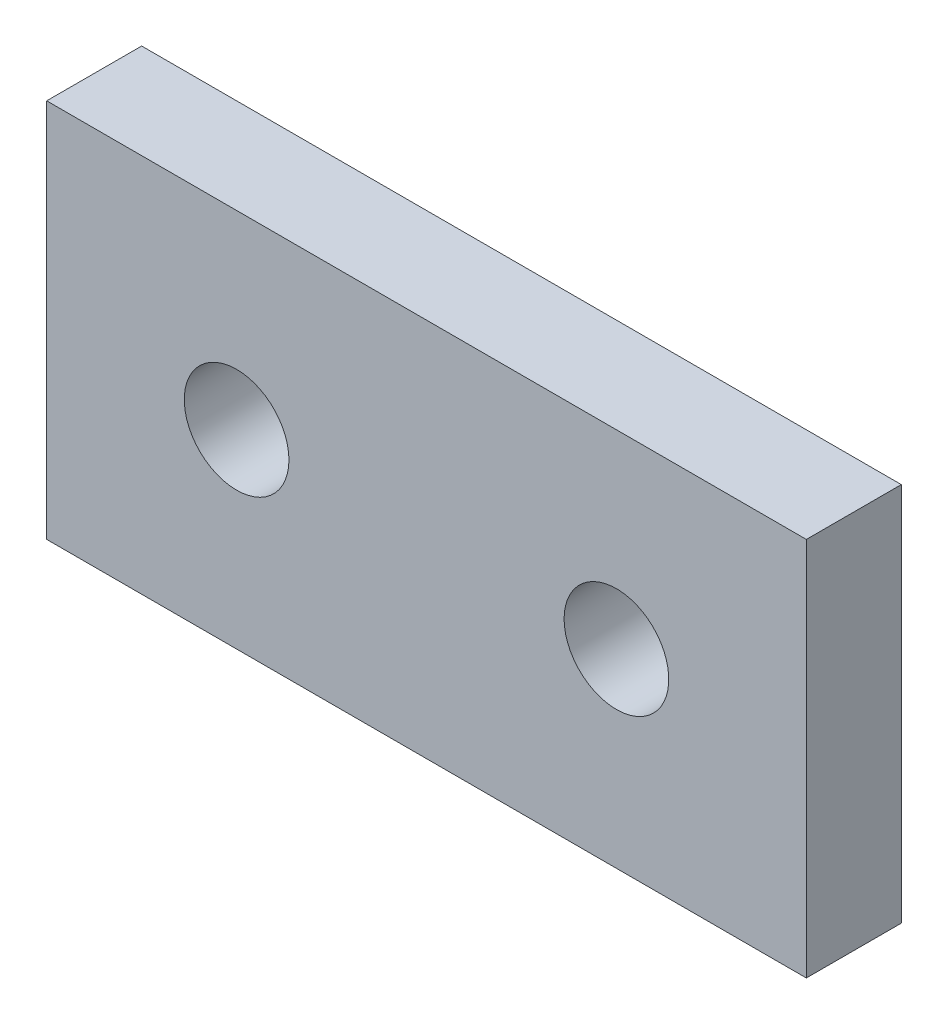
ISO-10303-21;
HEADER;
FILE_DESCRIPTION(('STEP AP214'),'2;1');
FILE_NAME('part.step','',(''),(''),'','','');
FILE_SCHEMA(('AUTOMOTIVE_DESIGN { 1 0 10303 214 1 1 1 1 }'));
ENDSEC;
DATA;
#1=APPLICATION_CONTEXT('core data for automotive mechanical design processes');
#2=APPLICATION_PROTOCOL_DEFINITION('international standard','automotive_design',2000,#1);
#3=PRODUCT_CONTEXT('',#1,'mechanical');
#4=PRODUCT('Part','Part','',(#3));
#5=PRODUCT_RELATED_PRODUCT_CATEGORY('part','',(#4));
#6=PRODUCT_DEFINITION_FORMATION('','',#4);
#7=PRODUCT_DEFINITION_CONTEXT('part definition',#1,'design');
#8=PRODUCT_DEFINITION('design','',#6,#7);
#9=PRODUCT_DEFINITION_SHAPE('','',#8);
#10=(LENGTH_UNIT() NAMED_UNIT(*) SI_UNIT(.MILLI.,.METRE.));
#11=(NAMED_UNIT(*) PLANE_ANGLE_UNIT() SI_UNIT($,.RADIAN.));
#12=(NAMED_UNIT(*) SI_UNIT($,.STERADIAN.) SOLID_ANGLE_UNIT());
#13=UNCERTAINTY_MEASURE_WITH_UNIT(LENGTH_MEASURE(1.E-05),#10,'distance_accuracy_value','');
#14=(GEOMETRIC_REPRESENTATION_CONTEXT(3) GLOBAL_UNCERTAINTY_ASSIGNED_CONTEXT((#13)) GLOBAL_UNIT_ASSIGNED_CONTEXT((#10,
#11,#12)) REPRESENTATION_CONTEXT('',''));
#15=CARTESIAN_POINT('',(0.,0.,0.));
#16=DIRECTION('',(0.,0.,1.));
#17=DIRECTION('',(1.,0.,0.));
#18=AXIS2_PLACEMENT_3D('',#15,#16,#17);
#19=CARTESIAN_POINT('',(0.,0.,6.35));
#20=DIRECTION('',(1.,0.,0.));
#21=DIRECTION('',(0.,0.,-1.));
#22=AXIS2_PLACEMENT_3D('',#19,#20,#21);
#23=PLANE('',#22);
#24=DIRECTION('',(0.,-1.,0.));
#25=VECTOR('',#24,1.);
#26=CARTESIAN_POINT('',(0.,0.,0.));
#27=LINE('',#26,#25);
#28=CARTESIAN_POINT('',(0.,25.4,0.));
#29=VERTEX_POINT('',#28);
#30=CARTESIAN_POINT('',(0.,0.,0.));
#31=VERTEX_POINT('',#30);
#32=EDGE_CURVE('E99',#29,#31,#27,.T.);
#33=ORIENTED_EDGE('',*,*,#32,.T.);
#34=DIRECTION('',(0.,0.,-1.));
#35=VECTOR('',#34,1.);
#36=CARTESIAN_POINT('',(0.,0.,6.35));
#37=LINE('',#36,#35);
#38=CARTESIAN_POINT('',(0.,0.,6.35));
#39=VERTEX_POINT('',#38);
#40=EDGE_CURVE('E11',#39,#31,#37,.T.);
#41=ORIENTED_EDGE('',*,*,#40,.F.);
#42=DIRECTION('',(0.,-1.,0.));
#43=VECTOR('',#42,1.);
#44=CARTESIAN_POINT('',(0.,0.,6.35));
#45=LINE('',#44,#43);
#46=CARTESIAN_POINT('',(0.,25.4,6.35));
#47=VERTEX_POINT('',#46);
#48=EDGE_CURVE('E87',#47,#39,#45,.T.);
#49=ORIENTED_EDGE('',*,*,#48,.F.);
#50=DIRECTION('',(0.,0.,-1.));
#51=VECTOR('',#50,1.);
#52=CARTESIAN_POINT('',(0.,25.4,6.35));
#53=LINE('',#52,#51);
#54=EDGE_CURVE('E95',#47,#29,#53,.T.);
#55=ORIENTED_EDGE('',*,*,#54,.T.);
#56=EDGE_LOOP('',(#33,#41,#49,#55));
#57=FACE_BOUND('',#56,.T.);
#58=ADVANCED_FACE('F36',(#57),#23,.F.);
#59=CARTESIAN_POINT('',(0.,0.,6.35));
#60=DIRECTION('',(0.,1.,0.));
#61=DIRECTION('',(0.,0.,1.));
#62=AXIS2_PLACEMENT_3D('',#59,#60,#61);
#63=PLANE('',#62);
#64=DIRECTION('',(1.,0.,0.));
#65=VECTOR('',#64,1.);
#66=CARTESIAN_POINT('',(0.,0.,0.));
#67=LINE('',#66,#65);
#68=CARTESIAN_POINT('',(50.8,0.,0.));
#69=VERTEX_POINT('',#68);
#70=EDGE_CURVE('E91',#31,#69,#67,.T.);
#71=ORIENTED_EDGE('',*,*,#70,.T.);
#72=DIRECTION('',(0.,0.,-1.));
#73=VECTOR('',#72,1.);
#74=CARTESIAN_POINT('',(50.8,0.,6.35));
#75=LINE('',#74,#73);
#76=CARTESIAN_POINT('',(50.8,0.,6.35));
#77=VERTEX_POINT('',#76);
#78=EDGE_CURVE('E44',#77,#69,#75,.T.);
#79=ORIENTED_EDGE('',*,*,#78,.F.);
#80=DIRECTION('',(1.,0.,0.));
#81=VECTOR('',#80,1.);
#82=CARTESIAN_POINT('',(0.,0.,6.35));
#83=LINE('',#82,#81);
#84=EDGE_CURVE('E82',#39,#77,#83,.T.);
#85=ORIENTED_EDGE('',*,*,#84,.F.);
#86=ORIENTED_EDGE('',*,*,#40,.T.);
#87=EDGE_LOOP('',(#71,#79,#85,#86));
#88=FACE_BOUND('',#87,.T.);
#89=ADVANCED_FACE('F90',(#88),#63,.F.);
#90=CARTESIAN_POINT('',(50.8,0.,6.35));
#91=DIRECTION('',(-1.,0.,0.));
#92=DIRECTION('',(0.,0.,1.));
#93=AXIS2_PLACEMENT_3D('',#90,#91,#92);
#94=PLANE('',#93);
#95=DIRECTION('',(0.,1.,0.));
#96=VECTOR('',#95,1.);
#97=CARTESIAN_POINT('',(50.8,0.,0.));
#98=LINE('',#97,#96);
#99=CARTESIAN_POINT('',(50.8,25.4,0.));
#100=VERTEX_POINT('',#99);
#101=EDGE_CURVE('E69',#69,#100,#98,.T.);
#102=ORIENTED_EDGE('',*,*,#101,.T.);
#103=DIRECTION('',(0.,0.,-1.));
#104=VECTOR('',#103,1.);
#105=CARTESIAN_POINT('',(50.8,25.4,6.35));
#106=LINE('',#105,#104);
#107=CARTESIAN_POINT('',(50.8,25.4,6.35));
#108=VERTEX_POINT('',#107);
#109=EDGE_CURVE('E92',#108,#100,#106,.T.);
#110=ORIENTED_EDGE('',*,*,#109,.F.);
#111=DIRECTION('',(0.,1.,0.));
#112=VECTOR('',#111,1.);
#113=CARTESIAN_POINT('',(50.8,0.,6.35));
#114=LINE('',#113,#112);
#115=EDGE_CURVE('E85',#77,#108,#114,.T.);
#116=ORIENTED_EDGE('',*,*,#115,.F.);
#117=ORIENTED_EDGE('',*,*,#78,.T.);
#118=EDGE_LOOP('',(#102,#110,#116,#117));
#119=FACE_BOUND('',#118,.T.);
#120=ADVANCED_FACE('F93',(#119),#94,.F.);
#121=CARTESIAN_POINT('',(0.,25.4,6.35));
#122=DIRECTION('',(0.,-1.,0.));
#123=DIRECTION('',(0.,0.,-1.));
#124=AXIS2_PLACEMENT_3D('',#121,#122,#123);
#125=PLANE('',#124);
#126=DIRECTION('',(-1.,0.,0.));
#127=VECTOR('',#126,1.);
#128=CARTESIAN_POINT('',(0.,25.4,0.));
#129=LINE('',#128,#127);
#130=EDGE_CURVE('E75',#100,#29,#129,.T.);
#131=ORIENTED_EDGE('',*,*,#130,.T.);
#132=ORIENTED_EDGE('',*,*,#54,.F.);
#133=DIRECTION('',(-1.,0.,0.));
#134=VECTOR('',#133,1.);
#135=CARTESIAN_POINT('',(0.,25.4,6.35));
#136=LINE('',#135,#134);
#137=EDGE_CURVE('E52',#108,#47,#136,.T.);
#138=ORIENTED_EDGE('',*,*,#137,.F.);
#139=ORIENTED_EDGE('',*,*,#109,.T.);
#140=EDGE_LOOP('',(#131,#132,#138,#139));
#141=FACE_BOUND('',#140,.T.);
#142=ADVANCED_FACE('F107',(#141),#125,.F.);
#143=CARTESIAN_POINT('',(0.,0.,6.35));
#144=DIRECTION('',(0.,0.,-1.));
#145=DIRECTION('',(-1.,0.,0.));
#146=AXIS2_PLACEMENT_3D('',#143,#144,#145);
#147=PLANE('',#146);
#148=CARTESIAN_POINT('',(12.7,12.7,6.35));
#149=DIRECTION('',(0.,0.,1.));
#150=DIRECTION('',(1.,0.,0.));
#151=AXIS2_PLACEMENT_3D('',#148,#149,#150);
#152=CIRCLE('',#151,3.5);
#153=CARTESIAN_POINT('',(16.2,12.7,6.35));
#154=VERTEX_POINT('',#153);
#155=EDGE_CURVE('E119',#154,#154,#152,.T.);
#156=ORIENTED_EDGE('',*,*,#155,.F.);
#157=EDGE_LOOP('',(#156));
#158=FACE_BOUND('',#157,.T.);
#159=CARTESIAN_POINT('',(38.1,12.7,6.35));
#160=DIRECTION('',(0.,0.,1.));
#161=DIRECTION('',(-1.,0.,0.));
#162=AXIS2_PLACEMENT_3D('',#159,#160,#161);
#163=CIRCLE('',#162,3.49999999999999);
#164=CARTESIAN_POINT('',(34.6,12.7,6.35));
#165=VERTEX_POINT('',#164);
#166=EDGE_CURVE('E113',#165,#165,#163,.T.);
#167=ORIENTED_EDGE('',*,*,#166,.F.);
#168=EDGE_LOOP('',(#167));
#169=FACE_BOUND('',#168,.T.);
#170=ORIENTED_EDGE('',*,*,#48,.T.);
#171=ORIENTED_EDGE('',*,*,#84,.T.);
#172=ORIENTED_EDGE('',*,*,#115,.T.);
#173=ORIENTED_EDGE('',*,*,#137,.T.);
#174=EDGE_LOOP('',(#170,#171,#172,#173));
#175=FACE_BOUND('',#174,.T.);
#176=ADVANCED_FACE('F83',(#158,#169,#175),#147,.F.);
#177=CARTESIAN_POINT('',(0.,0.,0.));
#178=DIRECTION('',(0.,0.,-1.));
#179=DIRECTION('',(-1.,0.,0.));
#180=AXIS2_PLACEMENT_3D('',#177,#178,#179);
#181=PLANE('',#180);
#182=CARTESIAN_POINT('',(12.7,12.7,0.));
#183=DIRECTION('',(0.,0.,1.));
#184=DIRECTION('',(1.,0.,0.));
#185=AXIS2_PLACEMENT_3D('',#182,#183,#184);
#186=CIRCLE('',#185,3.5);
#187=CARTESIAN_POINT('',(16.2,12.7,0.));
#188=VERTEX_POINT('',#187);
#189=EDGE_CURVE('E102',#188,#188,#186,.T.);
#190=ORIENTED_EDGE('',*,*,#189,.T.);
#191=EDGE_LOOP('',(#190));
#192=FACE_BOUND('',#191,.T.);
#193=CARTESIAN_POINT('',(38.1,12.7,0.));
#194=DIRECTION('',(0.,0.,1.));
#195=DIRECTION('',(-1.,0.,0.));
#196=AXIS2_PLACEMENT_3D('',#193,#194,#195);
#197=CIRCLE('',#196,3.49999999999999);
#198=CARTESIAN_POINT('',(34.6,12.7,0.));
#199=VERTEX_POINT('',#198);
#200=EDGE_CURVE('E116',#199,#199,#197,.T.);
#201=ORIENTED_EDGE('',*,*,#200,.T.);
#202=EDGE_LOOP('',(#201));
#203=FACE_BOUND('',#202,.T.);
#204=ORIENTED_EDGE('',*,*,#32,.F.);
#205=ORIENTED_EDGE('',*,*,#130,.F.);
#206=ORIENTED_EDGE('',*,*,#101,.F.);
#207=ORIENTED_EDGE('',*,*,#70,.F.);
#208=EDGE_LOOP('',(#204,#205,#206,#207));
#209=FACE_BOUND('',#208,.T.);
#210=ADVANCED_FACE('F110',(#192,#203,#209),#181,.T.);
#211=CARTESIAN_POINT('',(38.1,12.7,0.));
#212=DIRECTION('',(0.,0.,1.));
#213=DIRECTION('',(1.,0.,0.));
#214=AXIS2_PLACEMENT_3D('',#211,#212,#213);
#215=CYLINDRICAL_SURFACE('',#214,3.49999999999999);
#216=ORIENTED_EDGE('',*,*,#200,.F.);
#217=EDGE_LOOP('',(#216));
#218=FACE_BOUND('',#217,.T.);
#219=ORIENTED_EDGE('',*,*,#166,.T.);
#220=EDGE_LOOP('',(#219));
#221=FACE_BOUND('',#220,.T.);
#222=ADVANCED_FACE('F130',(#218,#221),#215,.F.);
#223=CARTESIAN_POINT('',(12.7,12.7,0.));
#224=DIRECTION('',(0.,0.,1.));
#225=DIRECTION('',(1.,0.,0.));
#226=AXIS2_PLACEMENT_3D('',#223,#224,#225);
#227=CYLINDRICAL_SURFACE('',#226,3.5);
#228=ORIENTED_EDGE('',*,*,#189,.F.);
#229=EDGE_LOOP('',(#228));
#230=FACE_BOUND('',#229,.T.);
#231=ORIENTED_EDGE('',*,*,#155,.T.);
#232=EDGE_LOOP('',(#231));
#233=FACE_BOUND('',#232,.T.);
#234=ADVANCED_FACE('F127',(#230,#233),#227,.F.);
#235=CLOSED_SHELL('',(#58,#89,#120,#142,#176,#210,#222,#234));
#236=MANIFOLD_SOLID_BREP('B2',#235);
#237=ADVANCED_BREP_SHAPE_REPRESENTATION('',(#18,#236),#14);
#238=SHAPE_DEFINITION_REPRESENTATION(#9,#237);
ENDSEC;
END-ISO-10303-21;
